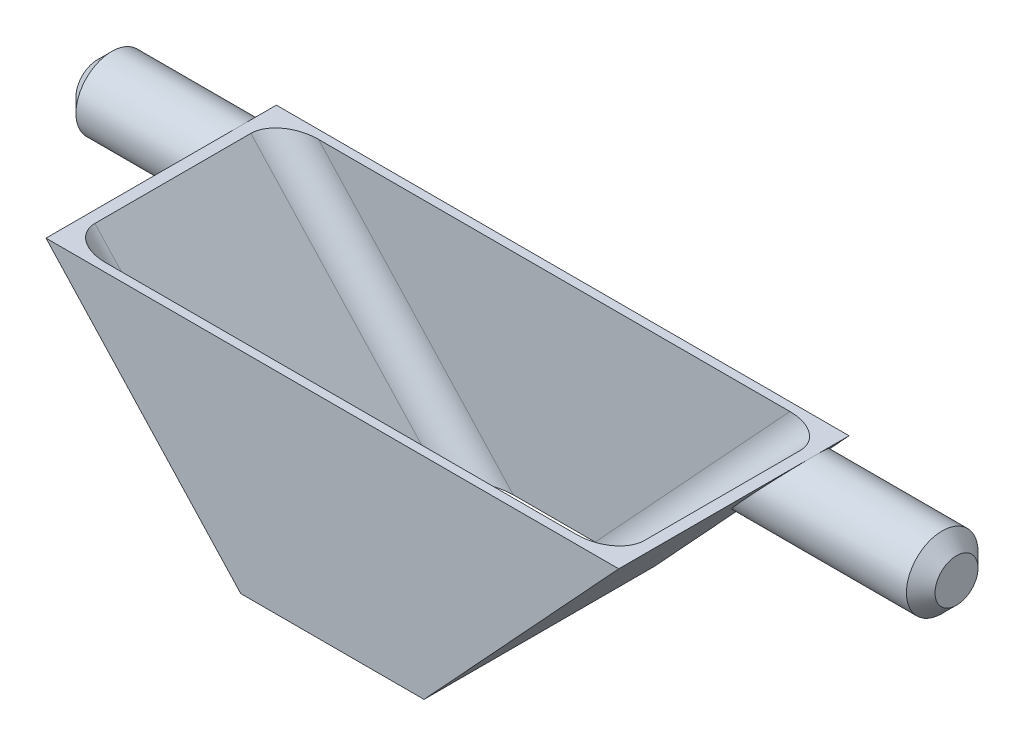
ISO-10303-21;
HEADER;
FILE_DESCRIPTION(('STEP AP214'),'2;1');
FILE_NAME('part.step','',(''),(''),'','','');
FILE_SCHEMA(('AUTOMOTIVE_DESIGN { 1 0 10303 214 1 1 1 1 }'));
ENDSEC;
DATA;
#1=APPLICATION_CONTEXT('core data for automotive mechanical design processes');
#2=APPLICATION_PROTOCOL_DEFINITION('international standard','automotive_design',2000,#1);
#3=PRODUCT_CONTEXT('',#1,'mechanical');
#4=PRODUCT('Part','Part','',(#3));
#5=PRODUCT_RELATED_PRODUCT_CATEGORY('part','',(#4));
#6=PRODUCT_DEFINITION_FORMATION('','',#4);
#7=PRODUCT_DEFINITION_CONTEXT('part definition',#1,'design');
#8=PRODUCT_DEFINITION('design','',#6,#7);
#9=PRODUCT_DEFINITION_SHAPE('','',#8);
#10=(LENGTH_UNIT() NAMED_UNIT(*) SI_UNIT(.MILLI.,.METRE.));
#11=(NAMED_UNIT(*) PLANE_ANGLE_UNIT() SI_UNIT($,.RADIAN.));
#12=(NAMED_UNIT(*) SI_UNIT($,.STERADIAN.) SOLID_ANGLE_UNIT());
#13=UNCERTAINTY_MEASURE_WITH_UNIT(LENGTH_MEASURE(1.E-05),#10,'distance_accuracy_value','');
#14=(GEOMETRIC_REPRESENTATION_CONTEXT(3) GLOBAL_UNCERTAINTY_ASSIGNED_CONTEXT((#13)) GLOBAL_UNIT_ASSIGNED_CONTEXT((#10,
#11,#12)) REPRESENTATION_CONTEXT('',''));
#15=CARTESIAN_POINT('',(0.,0.,0.));
#16=DIRECTION('',(0.,0.,1.));
#17=DIRECTION('',(1.,0.,0.));
#18=AXIS2_PLACEMENT_3D('',#15,#16,#17);
#19=CARTESIAN_POINT('',(-6.4,0.,16.09));
#20=DIRECTION('',(0.734037207583473,0.679109253274506,0.));
#21=DIRECTION('',(-0.679109253274506,0.734037207583473,0.));
#22=AXIS2_PLACEMENT_3D('',#19,#20,#21);
#23=PLANE('',#22);
#24=DIRECTION('',(0.,0.,-1.));
#25=VECTOR('',#24,1.);
#26=CARTESIAN_POINT('',(-20.,14.7,16.09));
#27=LINE('',#26,#25);
#28=CARTESIAN_POINT('',(-20.,14.7,16.09));
#29=VERTEX_POINT('',#28);
#30=CARTESIAN_POINT('',(-20.,14.7,2.5));
#31=VERTEX_POINT('',#30);
#32=EDGE_CURVE('E166',#29,#31,#27,.T.);
#33=ORIENTED_EDGE('',*,*,#32,.T.);
#34=CARTESIAN_POINT('',(-17.687074829932,12.2,2.5));
#35=DIRECTION('',(0.734037207583473,0.679109253274506,0.));
#36=DIRECTION('',(-0.679109253274506,0.734037207583473,0.));
#37=AXIS2_PLACEMENT_3D('',#34,#35,#36);
#38=ELLIPSE('',#37,3.40582190408339,2.5);
#39=CARTESIAN_POINT('',(-17.687074829932,12.2,0.));
#40=VERTEX_POINT('',#39);
#41=EDGE_CURVE('E65',#31,#40,#38,.T.);
#42=ORIENTED_EDGE('',*,*,#41,.T.);
#43=DIRECTION('',(0.679109253274506,-0.734037207583473,0.));
#44=VECTOR('',#43,1.);
#45=CARTESIAN_POINT('',(-6.4,0.,0.));
#46=LINE('',#45,#44);
#47=CARTESIAN_POINT('',(-6.4,0.,0.));
#48=VERTEX_POINT('',#47);
#49=EDGE_CURVE('E162',#40,#48,#46,.T.);
#50=ORIENTED_EDGE('',*,*,#49,.T.);
#51=DIRECTION('',(0.,0.,-1.));
#52=VECTOR('',#51,1.);
#53=CARTESIAN_POINT('',(-6.4,0.,16.09));
#54=LINE('',#53,#52);
#55=CARTESIAN_POINT('',(-6.4,0.,16.09));
#56=VERTEX_POINT('',#55);
#57=EDGE_CURVE('E195',#56,#48,#54,.T.);
#58=ORIENTED_EDGE('',*,*,#57,.F.);
#59=DIRECTION('',(0.679109253274506,-0.734037207583473,0.));
#60=VECTOR('',#59,1.);
#61=CARTESIAN_POINT('',(-6.4,0.,16.09));
#62=LINE('',#61,#60);
#63=EDGE_CURVE('E250',#29,#56,#62,.T.);
#64=ORIENTED_EDGE('',*,*,#63,.F.);
#65=EDGE_LOOP('',(#33,#42,#50,#58,#64));
#66=FACE_BOUND('',#65,.T.);
#67=ADVANCED_FACE('F50',(#66),#23,.F.);
#68=CARTESIAN_POINT('',(20.,14.7,16.09));
#69=DIRECTION('',(-0.734037207583473,0.679109253274506,0.));
#70=DIRECTION('',(-0.679109253274506,-0.734037207583473,0.));
#71=AXIS2_PLACEMENT_3D('',#68,#69,#70);
#72=PLANE('',#71);
#73=CARTESIAN_POINT('',(17.687074829932,12.2,2.5));
#74=DIRECTION('',(-0.734037207583473,0.679109253274506,0.));
#75=DIRECTION('',(0.679109253274506,0.734037207583473,0.));
#76=AXIS2_PLACEMENT_3D('',#73,#74,#75);
#77=ELLIPSE('',#76,3.40582190408339,2.5);
#78=CARTESIAN_POINT('',(20.,14.7,2.5));
#79=VERTEX_POINT('',#78);
#80=CARTESIAN_POINT('',(17.687074829932,12.2,0.));
#81=VERTEX_POINT('',#80);
#82=EDGE_CURVE('E168',#79,#81,#77,.F.);
#83=ORIENTED_EDGE('',*,*,#82,.F.);
#84=DIRECTION('',(0.,0.,-1.));
#85=VECTOR('',#84,1.);
#86=CARTESIAN_POINT('',(20.,14.7,16.09));
#87=LINE('',#86,#85);
#88=CARTESIAN_POINT('',(20.,14.7,16.09));
#89=VERTEX_POINT('',#88);
#90=EDGE_CURVE('E219',#89,#79,#87,.T.);
#91=ORIENTED_EDGE('',*,*,#90,.F.);
#92=DIRECTION('',(0.679109253274506,0.734037207583473,0.));
#93=VECTOR('',#92,1.);
#94=CARTESIAN_POINT('',(20.,14.7,16.09));
#95=LINE('',#94,#93);
#96=CARTESIAN_POINT('',(6.4,0.,16.09));
#97=VERTEX_POINT('',#96);
#98=EDGE_CURVE('E188',#97,#89,#95,.T.);
#99=ORIENTED_EDGE('',*,*,#98,.F.);
#100=DIRECTION('',(0.,0.,-1.));
#101=VECTOR('',#100,1.);
#102=CARTESIAN_POINT('',(6.4,0.,16.09));
#103=LINE('',#102,#101);
#104=CARTESIAN_POINT('',(6.4,0.,0.));
#105=VERTEX_POINT('',#104);
#106=EDGE_CURVE('E637',#97,#105,#103,.T.);
#107=ORIENTED_EDGE('',*,*,#106,.T.);
#108=DIRECTION('',(0.679109253274506,0.734037207583473,0.));
#109=VECTOR('',#108,1.);
#110=CARTESIAN_POINT('',(20.,14.7,0.));
#111=LINE('',#110,#109);
#112=EDGE_CURVE('E259',#105,#81,#111,.T.);
#113=ORIENTED_EDGE('',*,*,#112,.T.);
#114=EDGE_LOOP('',(#83,#91,#99,#107,#113));
#115=FACE_BOUND('',#114,.T.);
#116=ADVANCED_FACE('F357',(#115),#72,.F.);
#117=CARTESIAN_POINT('',(6.4,0.,16.09));
#118=DIRECTION('',(0.,1.,0.));
#119=DIRECTION('',(0.,0.,1.));
#120=AXIS2_PLACEMENT_3D('',#117,#118,#119);
#121=PLANE('',#120);
#122=DIRECTION('',(1.,0.,0.));
#123=VECTOR('',#122,1.);
#124=CARTESIAN_POINT('',(6.4,0.,0.));
#125=LINE('',#124,#123);
#126=EDGE_CURVE('E176',#48,#105,#125,.T.);
#127=ORIENTED_EDGE('',*,*,#126,.T.);
#128=ORIENTED_EDGE('',*,*,#106,.F.);
#129=DIRECTION('',(1.,0.,0.));
#130=VECTOR('',#129,1.);
#131=CARTESIAN_POINT('',(6.4,0.,16.09));
#132=LINE('',#131,#130);
#133=EDGE_CURVE('E184',#56,#97,#132,.T.);
#134=ORIENTED_EDGE('',*,*,#133,.F.);
#135=ORIENTED_EDGE('',*,*,#57,.T.);
#136=EDGE_LOOP('',(#127,#128,#134,#135));
#137=FACE_BOUND('',#136,.T.);
#138=DIRECTION('',(1.,0.,0.));
#139=VECTOR('',#138,1.);
#140=CARTESIAN_POINT('',(0.,0.,0.6));
#141=LINE('',#140,#139);
#142=CARTESIAN_POINT('',(-2.85794521975328,0.,0.6));
#143=VERTEX_POINT('',#142);
#144=CARTESIAN_POINT('',(2.85794521975327,0.,0.6));
#145=VERTEX_POINT('',#144);
#146=EDGE_CURVE('E270',#143,#145,#141,.T.);
#147=ORIENTED_EDGE('',*,*,#146,.F.);
#148=CARTESIAN_POINT('',(-2.85794521975327,0.,2.6));
#149=DIRECTION('',(0.,1.,0.));
#150=DIRECTION('',(1.,0.,0.));
#151=AXIS2_PLACEMENT_3D('',#148,#149,#150);
#152=ELLIPSE('',#151,2.72465752326671,2.);
#153=CARTESIAN_POINT('',(-5.58260274301999,0.,2.6));
#154=VERTEX_POINT('',#153);
#155=EDGE_CURVE('E236',#143,#154,#152,.T.);
#156=ORIENTED_EDGE('',*,*,#155,.T.);
#157=DIRECTION('',(0.,0.,-1.));
#158=VECTOR('',#157,1.);
#159=CARTESIAN_POINT('',(-5.58260274301999,0.,16.09));
#160=LINE('',#159,#158);
#161=CARTESIAN_POINT('',(-5.58260274301999,0.,13.49));
#162=VERTEX_POINT('',#161);
#163=EDGE_CURVE('E276',#162,#154,#160,.T.);
#164=ORIENTED_EDGE('',*,*,#163,.F.);
#165=CARTESIAN_POINT('',(-2.85794521975327,0.,13.49));
#166=DIRECTION('',(0.,1.,0.));
#167=DIRECTION('',(-1.,0.,0.));
#168=AXIS2_PLACEMENT_3D('',#165,#166,#167);
#169=ELLIPSE('',#168,2.72465752326671,2.);
#170=CARTESIAN_POINT('',(-2.85794521975327,0.,15.49));
#171=VERTEX_POINT('',#170);
#172=EDGE_CURVE('E659',#162,#171,#169,.T.);
#173=ORIENTED_EDGE('',*,*,#172,.T.);
#174=DIRECTION('',(1.,0.,0.));
#175=VECTOR('',#174,1.);
#176=CARTESIAN_POINT('',(0.,0.,15.49));
#177=LINE('',#176,#175);
#178=CARTESIAN_POINT('',(2.85794521975328,0.,15.49));
#179=VERTEX_POINT('',#178);
#180=EDGE_CURVE('E626',#171,#179,#177,.T.);
#181=ORIENTED_EDGE('',*,*,#180,.T.);
#182=CARTESIAN_POINT('',(2.85794521975327,0.,13.49));
#183=DIRECTION('',(0.,1.,0.));
#184=DIRECTION('',(-1.,0.,0.));
#185=AXIS2_PLACEMENT_3D('',#182,#183,#184);
#186=ELLIPSE('',#185,2.72465752326671,2.);
#187=CARTESIAN_POINT('',(5.58260274301998,0.,13.49));
#188=VERTEX_POINT('',#187);
#189=EDGE_CURVE('E663',#179,#188,#186,.T.);
#190=ORIENTED_EDGE('',*,*,#189,.T.);
#191=DIRECTION('',(0.,0.,-1.));
#192=VECTOR('',#191,1.);
#193=CARTESIAN_POINT('',(5.58260274301998,0.,16.09));
#194=LINE('',#193,#192);
#195=CARTESIAN_POINT('',(5.58260274301998,0.,2.6));
#196=VERTEX_POINT('',#195);
#197=EDGE_CURVE('E258',#188,#196,#194,.T.);
#198=ORIENTED_EDGE('',*,*,#197,.T.);
#199=CARTESIAN_POINT('',(2.85794521975327,0.,2.6));
#200=DIRECTION('',(0.,1.,0.));
#201=DIRECTION('',(1.,0.,0.));
#202=AXIS2_PLACEMENT_3D('',#199,#200,#201);
#203=ELLIPSE('',#202,2.72465752326671,2.);
#204=EDGE_CURVE('E230',#196,#145,#203,.T.);
#205=ORIENTED_EDGE('',*,*,#204,.T.);
#206=EDGE_LOOP('',(#147,#156,#164,#173,#181,#190,#198,#205));
#207=FACE_BOUND('',#206,.T.);
#208=ADVANCED_FACE('F362',(#137,#207),#121,.F.);
#209=CARTESIAN_POINT('',(-20.,14.7,16.09));
#210=DIRECTION('',(0.,-1.,0.));
#211=DIRECTION('',(0.,0.,-1.));
#212=AXIS2_PLACEMENT_3D('',#209,#210,#211);
#213=PLANE('',#212);
#214=DIRECTION('',(-1.,0.,0.));
#215=VECTOR('',#214,1.);
#216=CARTESIAN_POINT('',(-20.,14.7,0.));
#217=LINE('',#216,#215);
#218=CARTESIAN_POINT('',(20.,14.7,0.));
#219=VERTEX_POINT('',#218);
#220=CARTESIAN_POINT('',(-20.,14.7,0.));
#221=VERTEX_POINT('',#220);
#222=EDGE_CURVE('E178',#219,#221,#217,.T.);
#223=ORIENTED_EDGE('',*,*,#222,.T.);
#224=EDGE_CURVE('E181',#31,#221,#27,.T.);
#225=ORIENTED_EDGE('',*,*,#224,.F.);
#226=ORIENTED_EDGE('',*,*,#32,.F.);
#227=DIRECTION('',(-1.,0.,0.));
#228=VECTOR('',#227,1.);
#229=CARTESIAN_POINT('',(-20.,14.7,16.09));
#230=LINE('',#229,#228);
#231=EDGE_CURVE('E246',#89,#29,#230,.T.);
#232=ORIENTED_EDGE('',*,*,#231,.F.);
#233=ORIENTED_EDGE('',*,*,#90,.T.);
#234=EDGE_CURVE('E218',#79,#219,#87,.T.);
#235=ORIENTED_EDGE('',*,*,#234,.T.);
#236=EDGE_LOOP('',(#223,#225,#226,#232,#233,#235));
#237=FACE_BOUND('',#236,.T.);
#238=DIRECTION('',(-1.,0.,0.));
#239=VECTOR('',#238,1.);
#240=CARTESIAN_POINT('',(0.,14.7,0.6));
#241=LINE('',#240,#239);
#242=CARTESIAN_POINT('',(16.4579452197533,14.7,0.6));
#243=VERTEX_POINT('',#242);
#244=CARTESIAN_POINT('',(-16.4579452197533,14.7,0.6));
#245=VERTEX_POINT('',#244);
#246=EDGE_CURVE('E275',#243,#245,#241,.T.);
#247=ORIENTED_EDGE('',*,*,#246,.F.);
#248=CARTESIAN_POINT('',(16.4579452197533,14.7,2.6));
#249=DIRECTION('',(0.,-1.,0.));
#250=DIRECTION('',(1.,0.,0.));
#251=AXIS2_PLACEMENT_3D('',#248,#249,#250);
#252=ELLIPSE('',#251,2.72465752326671,2.);
#253=CARTESIAN_POINT('',(19.18260274302,14.7,2.6));
#254=VERTEX_POINT('',#253);
#255=EDGE_CURVE('E225',#243,#254,#252,.T.);
#256=ORIENTED_EDGE('',*,*,#255,.T.);
#257=DIRECTION('',(0.,0.,-1.));
#258=VECTOR('',#257,1.);
#259=CARTESIAN_POINT('',(19.18260274302,14.7,16.09));
#260=LINE('',#259,#258);
#261=CARTESIAN_POINT('',(19.18260274302,14.7,13.49));
#262=VERTEX_POINT('',#261);
#263=EDGE_CURVE('E323',#262,#254,#260,.T.);
#264=ORIENTED_EDGE('',*,*,#263,.F.);
#265=CARTESIAN_POINT('',(16.4579452197533,14.7,13.49));
#266=DIRECTION('',(0.,-1.,0.));
#267=DIRECTION('',(-1.,0.,0.));
#268=AXIS2_PLACEMENT_3D('',#265,#266,#267);
#269=ELLIPSE('',#268,2.72465752326671,2.);
#270=CARTESIAN_POINT('',(16.4579452197533,14.7,15.49));
#271=VERTEX_POINT('',#270);
#272=EDGE_CURVE('E666',#262,#271,#269,.T.);
#273=ORIENTED_EDGE('',*,*,#272,.T.);
#274=DIRECTION('',(-1.,0.,0.));
#275=VECTOR('',#274,1.);
#276=CARTESIAN_POINT('',(0.,14.7,15.49));
#277=LINE('',#276,#275);
#278=CARTESIAN_POINT('',(-16.4579452197533,14.7,15.49));
#279=VERTEX_POINT('',#278);
#280=EDGE_CURVE('E629',#271,#279,#277,.T.);
#281=ORIENTED_EDGE('',*,*,#280,.T.);
#282=CARTESIAN_POINT('',(-16.4579452197533,14.7,13.49));
#283=DIRECTION('',(0.,-1.,0.));
#284=DIRECTION('',(-1.,0.,0.));
#285=AXIS2_PLACEMENT_3D('',#282,#283,#284);
#286=ELLIPSE('',#285,2.72465752326671,2.);
#287=CARTESIAN_POINT('',(-19.18260274302,14.7,13.49));
#288=VERTEX_POINT('',#287);
#289=EDGE_CURVE('E321',#279,#288,#286,.T.);
#290=ORIENTED_EDGE('',*,*,#289,.T.);
#291=DIRECTION('',(0.,0.,-1.));
#292=VECTOR('',#291,1.);
#293=CARTESIAN_POINT('',(-19.18260274302,14.7,16.09));
#294=LINE('',#293,#292);
#295=CARTESIAN_POINT('',(-19.18260274302,14.7,2.6));
#296=VERTEX_POINT('',#295);
#297=EDGE_CURVE('E309',#288,#296,#294,.T.);
#298=ORIENTED_EDGE('',*,*,#297,.T.);
#299=CARTESIAN_POINT('',(-16.4579452197533,14.7,2.6));
#300=DIRECTION('',(0.,-1.,0.));
#301=DIRECTION('',(1.,0.,0.));
#302=AXIS2_PLACEMENT_3D('',#299,#300,#301);
#303=ELLIPSE('',#302,2.72465752326671,2.);
#304=EDGE_CURVE('E317',#296,#245,#303,.T.);
#305=ORIENTED_EDGE('',*,*,#304,.T.);
#306=EDGE_LOOP('',(#247,#256,#264,#273,#281,#290,#298,#305));
#307=FACE_BOUND('',#306,.T.);
#308=ADVANCED_FACE('F316',(#237,#307),#213,.F.);
#309=EDGE_CURVE('E73',#81,#79,#77,.F.);
#310=ORIENTED_EDGE('',*,*,#309,.F.);
#311=EDGE_CURVE('E257',#81,#219,#111,.T.);
#312=ORIENTED_EDGE('',*,*,#311,.T.);
#313=ORIENTED_EDGE('',*,*,#234,.F.);
#314=EDGE_LOOP('',(#310,#312,#313));
#315=FACE_BOUND('',#314,.T.);
#316=ADVANCED_FACE('F365',(#315),#72,.F.);
#317=EDGE_CURVE('E174',#221,#40,#46,.T.);
#318=ORIENTED_EDGE('',*,*,#317,.T.);
#319=EDGE_CURVE('E150',#40,#31,#38,.T.);
#320=ORIENTED_EDGE('',*,*,#319,.T.);
#321=ORIENTED_EDGE('',*,*,#224,.T.);
#322=EDGE_LOOP('',(#318,#320,#321));
#323=FACE_BOUND('',#322,.T.);
#324=ADVANCED_FACE('F180',(#323),#23,.F.);
#325=CARTESIAN_POINT('',(0.,0.,16.09));
#326=DIRECTION('',(0.,0.,-1.));
#327=DIRECTION('',(-1.,0.,0.));
#328=AXIS2_PLACEMENT_3D('',#325,#326,#327);
#329=PLANE('',#328);
#330=ORIENTED_EDGE('',*,*,#133,.T.);
#331=ORIENTED_EDGE('',*,*,#98,.T.);
#332=ORIENTED_EDGE('',*,*,#231,.T.);
#333=ORIENTED_EDGE('',*,*,#63,.T.);
#334=EDGE_LOOP('',(#330,#331,#332,#333));
#335=FACE_BOUND('',#334,.T.);
#336=ADVANCED_FACE('F369',(#335),#329,.F.);
#337=CARTESIAN_POINT('',(0.,0.,0.));
#338=DIRECTION('',(0.,0.,-1.));
#339=DIRECTION('',(-1.,0.,0.));
#340=AXIS2_PLACEMENT_3D('',#337,#338,#339);
#341=PLANE('',#340);
#342=ORIENTED_EDGE('',*,*,#126,.F.);
#343=ORIENTED_EDGE('',*,*,#49,.F.);
#344=ORIENTED_EDGE('',*,*,#317,.F.);
#345=ORIENTED_EDGE('',*,*,#222,.F.);
#346=ORIENTED_EDGE('',*,*,#311,.F.);
#347=ORIENTED_EDGE('',*,*,#112,.F.);
#348=EDGE_LOOP('',(#342,#343,#344,#345,#346,#347));
#349=FACE_BOUND('',#348,.T.);
#350=ADVANCED_FACE('F172',(#349),#341,.T.);
#351=CARTESIAN_POINT('',(19.5595776754499,15.1074655519647,16.09));
#352=DIRECTION('',(-0.734037207583473,0.679109253274506,0.));
#353=DIRECTION('',(-0.679109253274506,-0.734037207583473,0.));
#354=AXIS2_PLACEMENT_3D('',#351,#352,#353);
#355=PLANE('',#354);
#356=ORIENTED_EDGE('',*,*,#263,.T.);
#357=DIRECTION('',(0.679109253274506,0.734037207583473,0.));
#358=VECTOR('',#357,1.);
#359=CARTESIAN_POINT('',(19.5595776754499,15.1074655519647,2.6));
#360=LINE('',#359,#358);
#361=EDGE_CURVE('E289',#254,#196,#360,.F.);
#362=ORIENTED_EDGE('',*,*,#361,.T.);
#363=ORIENTED_EDGE('',*,*,#197,.F.);
#364=DIRECTION('',(0.679109253274506,0.734037207583473,0.));
#365=VECTOR('',#364,1.);
#366=CARTESIAN_POINT('',(19.18260274302,14.7,13.49));
#367=LINE('',#366,#365);
#368=EDGE_CURVE('E619',#188,#262,#367,.T.);
#369=ORIENTED_EDGE('',*,*,#368,.T.);
#370=EDGE_LOOP('',(#356,#362,#363,#369));
#371=FACE_BOUND('',#370,.T.);
#372=ADVANCED_FACE('F411',(#371),#355,.T.);
#373=CARTESIAN_POINT('',(-5.95957767544992,0.407465551964702,16.09));
#374=DIRECTION('',(0.734037207583473,0.679109253274506,0.));
#375=DIRECTION('',(-0.679109253274506,0.734037207583473,0.));
#376=AXIS2_PLACEMENT_3D('',#373,#374,#375);
#377=PLANE('',#376);
#378=ORIENTED_EDGE('',*,*,#163,.T.);
#379=DIRECTION('',(0.679109253274506,-0.734037207583473,0.));
#380=VECTOR('',#379,1.);
#381=CARTESIAN_POINT('',(-5.95957767544992,0.407465551964702,2.6));
#382=LINE('',#381,#380);
#383=EDGE_CURVE('E231',#154,#296,#382,.F.);
#384=ORIENTED_EDGE('',*,*,#383,.T.);
#385=ORIENTED_EDGE('',*,*,#297,.F.);
#386=DIRECTION('',(0.679109253274506,-0.734037207583473,0.));
#387=VECTOR('',#386,1.);
#388=CARTESIAN_POINT('',(-5.58260274301999,0.,13.49));
#389=LINE('',#388,#387);
#390=EDGE_CURVE('E670',#288,#162,#389,.T.);
#391=ORIENTED_EDGE('',*,*,#390,.T.);
#392=EDGE_LOOP('',(#378,#384,#385,#391));
#393=FACE_BOUND('',#392,.T.);
#394=ADVANCED_FACE('F307',(#393),#377,.T.);
#395=CARTESIAN_POINT('',(0.,0.,15.49));
#396=DIRECTION('',(0.,0.,-1.));
#397=DIRECTION('',(-1.,0.,0.));
#398=AXIS2_PLACEMENT_3D('',#395,#396,#397);
#399=PLANE('',#398);
#400=ORIENTED_EDGE('',*,*,#280,.F.);
#401=DIRECTION('',(0.679109253274506,0.734037207583473,0.));
#402=VECTOR('',#401,1.);
#403=CARTESIAN_POINT('',(4.11452832785304,1.35821850654901,15.49));
#404=LINE('',#403,#402);
#405=EDGE_CURVE('E673',#271,#179,#404,.F.);
#406=ORIENTED_EDGE('',*,*,#405,.T.);
#407=ORIENTED_EDGE('',*,*,#180,.F.);
#408=DIRECTION('',(0.679109253274506,-0.734037207583473,0.));
#409=VECTOR('',#408,1.);
#410=CARTESIAN_POINT('',(-17.714528327853,16.058218506549,15.49));
#411=LINE('',#410,#409);
#412=EDGE_CURVE('E645',#171,#279,#411,.F.);
#413=ORIENTED_EDGE('',*,*,#412,.T.);
#414=EDGE_LOOP('',(#400,#406,#407,#413));
#415=FACE_BOUND('',#414,.T.);
#416=ADVANCED_FACE('F416',(#415),#399,.T.);
#417=CARTESIAN_POINT('',(0.,0.,0.6));
#418=DIRECTION('',(0.,0.,-1.));
#419=DIRECTION('',(-1.,0.,0.));
#420=AXIS2_PLACEMENT_3D('',#417,#418,#419);
#421=PLANE('',#420);
#422=ORIENTED_EDGE('',*,*,#146,.T.);
#423=DIRECTION('',(0.679109253274506,0.734037207583473,0.));
#424=VECTOR('',#423,1.);
#425=CARTESIAN_POINT('',(1.5398912418314,-1.42466128495967,0.6));
#426=LINE('',#425,#424);
#427=EDGE_CURVE('E284',#145,#243,#426,.T.);
#428=ORIENTED_EDGE('',*,*,#427,.T.);
#429=ORIENTED_EDGE('',*,*,#246,.T.);
#430=DIRECTION('',(0.679109253274506,-0.734037207583473,0.));
#431=VECTOR('',#430,1.);
#432=CARTESIAN_POINT('',(-1.53989124183141,-1.42466128495967,0.6));
#433=LINE('',#432,#431);
#434=EDGE_CURVE('E290',#245,#143,#433,.T.);
#435=ORIENTED_EDGE('',*,*,#434,.T.);
#436=EDGE_LOOP('',(#422,#428,#429,#435));
#437=FACE_BOUND('',#436,.T.);
#438=ADVANCED_FACE('F388',(#437),#421,.F.);
#439=CARTESIAN_POINT('',(18.091503260283,16.4656840585137,13.49));
#440=DIRECTION('',(-0.679109253274506,-0.734037207583473,0.));
#441=DIRECTION('',(0.734037207583473,-0.679109253274506,0.));
#442=AXIS2_PLACEMENT_3D('',#439,#440,#441);
#443=CYLINDRICAL_SURFACE('',#442,2.);
#444=ORIENTED_EDGE('',*,*,#189,.F.);
#445=ORIENTED_EDGE('',*,*,#405,.F.);
#446=ORIENTED_EDGE('',*,*,#272,.F.);
#447=ORIENTED_EDGE('',*,*,#368,.F.);
#448=EDGE_LOOP('',(#444,#445,#446,#447));
#449=FACE_BOUND('',#448,.T.);
#450=ADVANCED_FACE('F384',(#449),#443,.F.);
#451=CARTESIAN_POINT('',(-4.49150326028297,1.76568405851371,13.49));
#452=DIRECTION('',(-0.679109253274506,0.734037207583473,0.));
#453=DIRECTION('',(-0.734037207583473,-0.679109253274506,0.));
#454=AXIS2_PLACEMENT_3D('',#451,#452,#453);
#455=CYLINDRICAL_SURFACE('',#454,2.);
#456=ORIENTED_EDGE('',*,*,#289,.F.);
#457=ORIENTED_EDGE('',*,*,#412,.F.);
#458=ORIENTED_EDGE('',*,*,#172,.F.);
#459=ORIENTED_EDGE('',*,*,#390,.F.);
#460=EDGE_LOOP('',(#456,#457,#458,#459));
#461=FACE_BOUND('',#460,.T.);
#462=ADVANCED_FACE('F387',(#461),#455,.F.);
#463=CARTESIAN_POINT('',(1.5398912418314,-1.42466128495967,2.6));
#464=DIRECTION('',(0.679109253274506,0.734037207583473,0.));
#465=DIRECTION('',(-0.734037207583473,0.679109253274506,0.));
#466=AXIS2_PLACEMENT_3D('',#463,#464,#465);
#467=CYLINDRICAL_SURFACE('',#466,2.);
#468=ORIENTED_EDGE('',*,*,#204,.F.);
#469=ORIENTED_EDGE('',*,*,#361,.F.);
#470=ORIENTED_EDGE('',*,*,#255,.F.);
#471=ORIENTED_EDGE('',*,*,#427,.F.);
#472=EDGE_LOOP('',(#468,#469,#470,#471));
#473=FACE_BOUND('',#472,.T.);
#474=ADVANCED_FACE('F392',(#473),#467,.F.);
#475=CARTESIAN_POINT('',(-1.53989124183141,-1.42466128495967,2.6));
#476=DIRECTION('',(0.679109253274506,-0.734037207583473,0.));
#477=DIRECTION('',(0.734037207583473,0.679109253274506,0.));
#478=AXIS2_PLACEMENT_3D('',#475,#476,#477);
#479=CYLINDRICAL_SURFACE('',#478,2.);
#480=ORIENTED_EDGE('',*,*,#304,.F.);
#481=ORIENTED_EDGE('',*,*,#383,.F.);
#482=ORIENTED_EDGE('',*,*,#155,.F.);
#483=ORIENTED_EDGE('',*,*,#434,.F.);
#484=EDGE_LOOP('',(#480,#481,#482,#483));
#485=FACE_BOUND('',#484,.T.);
#486=ADVANCED_FACE('F325',(#485),#479,.F.);
#487=CARTESIAN_POINT('',(-20.002,12.2,2.5));
#488=DIRECTION('',(1.,0.,0.));
#489=DIRECTION('',(0.,0.,-1.));
#490=AXIS2_PLACEMENT_3D('',#487,#488,#489);
#491=CYLINDRICAL_SURFACE('',#490,2.5);
#492=CARTESIAN_POINT('',(29.,12.2,2.5));
#493=DIRECTION('',(1.,0.,0.));
#494=DIRECTION('',(0.,0.,-1.));
#495=AXIS2_PLACEMENT_3D('',#492,#493,#494);
#496=CIRCLE('',#495,2.5);
#497=CARTESIAN_POINT('',(29.,12.2,0.));
#498=VERTEX_POINT('',#497);
#499=EDGE_CURVE('E12',#498,#498,#496,.F.);
#500=ORIENTED_EDGE('',*,*,#499,.T.);
#501=EDGE_LOOP('',(#500));
#502=FACE_BOUND('',#501,.T.);
#503=ORIENTED_EDGE('',*,*,#309,.T.);
#504=ORIENTED_EDGE('',*,*,#82,.T.);
#505=EDGE_LOOP('',(#503,#504));
#506=FACE_BOUND('',#505,.T.);
#507=ADVANCED_FACE('F398',(#502,#506),#491,.T.);
#508=CARTESIAN_POINT('',(30.,12.2,2.5));
#509=DIRECTION('',(1.,0.,0.));
#510=DIRECTION('',(0.,0.,-1.));
#511=AXIS2_PLACEMENT_3D('',#508,#509,#510);
#512=PLANE('',#511);
#513=CARTESIAN_POINT('',(30.,12.2,2.5));
#514=DIRECTION('',(1.,0.,0.));
#515=DIRECTION('',(0.,0.,-1.));
#516=AXIS2_PLACEMENT_3D('',#513,#514,#515);
#517=CIRCLE('',#516,1.49999999999999);
#518=CARTESIAN_POINT('',(30.,12.2,1.00000000000001));
#519=VERTEX_POINT('',#518);
#520=EDGE_CURVE('E59',#519,#519,#517,.T.);
#521=ORIENTED_EDGE('',*,*,#520,.T.);
#522=EDGE_LOOP('',(#521));
#523=FACE_BOUND('',#522,.T.);
#524=ADVANCED_FACE('F345',(#523),#512,.T.);
#525=CARTESIAN_POINT('',(30.002,12.2,2.5));
#526=DIRECTION('',(-1.,0.,0.));
#527=DIRECTION('',(0.,0.,1.));
#528=AXIS2_PLACEMENT_3D('',#525,#526,#527);
#529=CYLINDRICAL_SURFACE('',#528,2.5);
#530=CARTESIAN_POINT('',(-29.,12.2,2.5));
#531=DIRECTION('',(-1.,0.,0.));
#532=DIRECTION('',(0.,0.,1.));
#533=AXIS2_PLACEMENT_3D('',#530,#531,#532);
#534=CIRCLE('',#533,2.5);
#535=CARTESIAN_POINT('',(-29.,12.2,5.));
#536=VERTEX_POINT('',#535);
#537=EDGE_CURVE('E156',#536,#536,#534,.F.);
#538=ORIENTED_EDGE('',*,*,#537,.T.);
#539=EDGE_LOOP('',(#538));
#540=FACE_BOUND('',#539,.T.);
#541=ORIENTED_EDGE('',*,*,#41,.F.);
#542=ORIENTED_EDGE('',*,*,#319,.F.);
#543=EDGE_LOOP('',(#541,#542));
#544=FACE_BOUND('',#543,.T.);
#545=ADVANCED_FACE('F151',(#540,#544),#529,.T.);
#546=CARTESIAN_POINT('',(-30.,12.2,2.5));
#547=DIRECTION('',(-1.,0.,0.));
#548=DIRECTION('',(0.,0.,-1.));
#549=AXIS2_PLACEMENT_3D('',#546,#547,#548);
#550=PLANE('',#549);
#551=CARTESIAN_POINT('',(-30.,12.2,2.5));
#552=DIRECTION('',(-1.,0.,0.));
#553=DIRECTION('',(0.,0.,1.));
#554=AXIS2_PLACEMENT_3D('',#551,#552,#553);
#555=CIRCLE('',#554,1.49999999999998);
#556=CARTESIAN_POINT('',(-30.,12.2,3.99999999999998));
#557=VERTEX_POINT('',#556);
#558=EDGE_CURVE('E335',#557,#557,#555,.T.);
#559=ORIENTED_EDGE('',*,*,#558,.T.);
#560=EDGE_LOOP('',(#559));
#561=FACE_BOUND('',#560,.T.);
#562=ADVANCED_FACE('F353',(#561),#550,.T.);
#563=CARTESIAN_POINT('',(-29.,12.2,2.5));
#564=DIRECTION('',(1.,0.,0.));
#565=DIRECTION('',(0.,0.,-1.));
#566=AXIS2_PLACEMENT_3D('',#563,#564,#565);
#567=CONICAL_SURFACE('',#566,2.5,0.785398163397451);
#568=ORIENTED_EDGE('',*,*,#558,.F.);
#569=EDGE_LOOP('',(#568));
#570=FACE_BOUND('',#569,.T.);
#571=ORIENTED_EDGE('',*,*,#537,.F.);
#572=EDGE_LOOP('',(#571));
#573=FACE_BOUND('',#572,.T.);
#574=ADVANCED_FACE('F348',(#570,#573),#567,.T.);
#575=CARTESIAN_POINT('',(30.,12.2,2.5));
#576=DIRECTION('',(-1.,0.,0.));
#577=DIRECTION('',(0.,0.,1.));
#578=AXIS2_PLACEMENT_3D('',#575,#576,#577);
#579=CONICAL_SURFACE('',#578,1.49999999999999,0.785398163397447);
#580=ORIENTED_EDGE('',*,*,#499,.F.);
#581=EDGE_LOOP('',(#580));
#582=FACE_BOUND('',#581,.T.);
#583=ORIENTED_EDGE('',*,*,#520,.F.);
#584=EDGE_LOOP('',(#583));
#585=FACE_BOUND('',#584,.T.);
#586=ADVANCED_FACE('F52',(#582,#585),#579,.T.);
#587=CLOSED_SHELL('',(#67,#116,#208,#308,#316,#324,#336,#350,#372,#394,#416,#438,#450,#462,#474,
#486,#507,#524,#545,#562,#574,#586));
#588=MANIFOLD_SOLID_BREP('B2',#587);
#589=ADVANCED_BREP_SHAPE_REPRESENTATION('',(#18,#588),#14);
#590=SHAPE_DEFINITION_REPRESENTATION(#9,#589);
ENDSEC;
END-ISO-10303-21;
